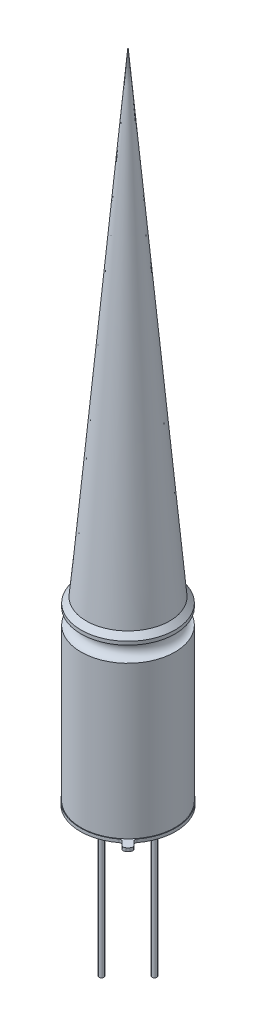
ISO-10303-21;
HEADER;
FILE_DESCRIPTION(('STEP AP214'),'2;1');
FILE_NAME('part.step','',(''),(''),'','','');
FILE_SCHEMA(('AUTOMOTIVE_DESIGN { 1 0 10303 214 1 1 1 1 }'));
ENDSEC;
DATA;
#1=APPLICATION_CONTEXT('core data for automotive mechanical design processes');
#2=APPLICATION_PROTOCOL_DEFINITION('international standard','automotive_design',2000,#1);
#3=PRODUCT_CONTEXT('',#1,'mechanical');
#4=PRODUCT('Part','Part','',(#3));
#5=PRODUCT_RELATED_PRODUCT_CATEGORY('part','',(#4));
#6=PRODUCT_DEFINITION_FORMATION('','',#4);
#7=PRODUCT_DEFINITION_CONTEXT('part definition',#1,'design');
#8=PRODUCT_DEFINITION('design','',#6,#7);
#9=PRODUCT_DEFINITION_SHAPE('','',#8);
#10=(LENGTH_UNIT() NAMED_UNIT(*) SI_UNIT(.MILLI.,.METRE.));
#11=(NAMED_UNIT(*) PLANE_ANGLE_UNIT() SI_UNIT($,.RADIAN.));
#12=(NAMED_UNIT(*) SI_UNIT($,.STERADIAN.) SOLID_ANGLE_UNIT());
#13=UNCERTAINTY_MEASURE_WITH_UNIT(LENGTH_MEASURE(1.E-05),#10,'distance_accuracy_value','');
#14=(GEOMETRIC_REPRESENTATION_CONTEXT(3) GLOBAL_UNCERTAINTY_ASSIGNED_CONTEXT((#13)) GLOBAL_UNIT_ASSIGNED_CONTEXT((#10,
#11,#12)) REPRESENTATION_CONTEXT('',''));
#15=CARTESIAN_POINT('',(0.,0.,0.));
#16=DIRECTION('',(0.,0.,1.));
#17=DIRECTION('',(1.,0.,0.));
#18=AXIS2_PLACEMENT_3D('',#15,#16,#17);
#19=CARTESIAN_POINT('',(0.,-1.58,0.));
#20=DIRECTION('',(0.,1.,0.));
#21=DIRECTION('',(0.,0.,1.));
#22=AXIS2_PLACEMENT_3D('',#19,#20,#21);
#23=TOROIDAL_SURFACE('',#22,4.5,0.749999999999999);
#24=CARTESIAN_POINT('',(0.,-2.33,0.));
#25=DIRECTION('',(0.,1.,0.));
#26=DIRECTION('',(0.,0.,1.));
#27=AXIS2_PLACEMENT_3D('',#24,#25,#26);
#28=CIRCLE('',#27,4.5);
#29=CARTESIAN_POINT('',(0.,-2.33,4.5));
#30=VERTEX_POINT('',#29);
#31=EDGE_CURVE('E203',#30,#30,#28,.T.);
#32=ORIENTED_EDGE('',*,*,#31,.T.);
#33=EDGE_LOOP('',(#32));
#34=FACE_BOUND('',#33,.T.);
#35=CARTESIAN_POINT('',(0.,-0.830000000000001,0.));
#36=DIRECTION('',(0.,1.,0.));
#37=DIRECTION('',(0.,0.,1.));
#38=AXIS2_PLACEMENT_3D('',#35,#36,#37);
#39=CIRCLE('',#38,4.5);
#40=CARTESIAN_POINT('',(0.,-0.830000000000001,4.5));
#41=VERTEX_POINT('',#40);
#42=EDGE_CURVE('E126',#41,#41,#39,.T.);
#43=ORIENTED_EDGE('',*,*,#42,.F.);
#44=EDGE_LOOP('',(#43));
#45=FACE_BOUND('',#44,.T.);
#46=ADVANCED_FACE('F47',(#34,#45),#23,.F.);
#47=CARTESIAN_POINT('',(0.,11.5793174767322,0.));
#48=DIRECTION('',(0.,1.,0.));
#49=DIRECTION('',(0.,0.,1.));
#50=AXIS2_PLACEMENT_3D('',#47,#48,#49);
#51=CYLINDRICAL_SURFACE('',#50,4.5);
#52=ORIENTED_EDGE('',*,*,#42,.T.);
#53=EDGE_LOOP('',(#52));
#54=FACE_BOUND('',#53,.T.);
#55=CARTESIAN_POINT('',(0.,-0.5,0.));
#56=DIRECTION('',(0.,1.,0.));
#57=DIRECTION('',(0.,0.,1.));
#58=AXIS2_PLACEMENT_3D('',#55,#56,#57);
#59=CIRCLE('',#58,4.5);
#60=CARTESIAN_POINT('',(0.,-0.5,4.5));
#61=VERTEX_POINT('',#60);
#62=EDGE_CURVE('E122',#61,#61,#59,.T.);
#63=ORIENTED_EDGE('',*,*,#62,.F.);
#64=EDGE_LOOP('',(#63));
#65=FACE_BOUND('',#64,.T.);
#66=ADVANCED_FACE('F254',(#54,#65),#51,.T.);
#67=CARTESIAN_POINT('',(0.,0.,0.));
#68=DIRECTION('',(0.,-1.,0.));
#69=DIRECTION('',(0.,0.,-1.));
#70=AXIS2_PLACEMENT_3D('',#67,#68,#69);
#71=CONICAL_SURFACE('',#70,4.,0.785398163397447);
#72=ORIENTED_EDGE('',*,*,#62,.T.);
#73=EDGE_LOOP('',(#72));
#74=FACE_BOUND('',#73,.T.);
#75=CARTESIAN_POINT('',(0.,0.,0.));
#76=DIRECTION('',(0.,1.,0.));
#77=DIRECTION('',(0.,0.,1.));
#78=AXIS2_PLACEMENT_3D('',#75,#76,#77);
#79=CIRCLE('',#78,4.);
#80=CARTESIAN_POINT('',(0.,0.,4.));
#81=VERTEX_POINT('',#80);
#82=EDGE_CURVE('E120',#81,#81,#79,.T.);
#83=ORIENTED_EDGE('',*,*,#82,.F.);
#84=EDGE_LOOP('',(#83));
#85=FACE_BOUND('',#84,.T.);
#86=ADVANCED_FACE('F259',(#74,#85),#71,.T.);
#87=CARTESIAN_POINT('',(0.,-17.2,0.));
#88=DIRECTION('',(0.,1.,0.));
#89=DIRECTION('',(0.,0.,1.));
#90=AXIS2_PLACEMENT_3D('',#87,#88,#89);
#91=PLANE('',#90);
#92=CARTESIAN_POINT('',(0.,-17.2,-2.54));
#93=DIRECTION('',(0.,1.,0.));
#94=DIRECTION('',(0.,0.,1.));
#95=AXIS2_PLACEMENT_3D('',#92,#93,#94);
#96=CIRCLE('',#95,0.225);
#97=CARTESIAN_POINT('',(0.,-17.2,-2.315));
#98=VERTEX_POINT('',#97);
#99=EDGE_CURVE('E144',#98,#98,#96,.F.);
#100=ORIENTED_EDGE('',*,*,#99,.F.);
#101=EDGE_LOOP('',(#100));
#102=FACE_BOUND('',#101,.T.);
#103=CARTESIAN_POINT('',(2.54,-17.2,0.));
#104=DIRECTION('',(0.,1.,0.));
#105=DIRECTION('',(0.,0.,1.));
#106=AXIS2_PLACEMENT_3D('',#103,#104,#105);
#107=CIRCLE('',#106,0.225);
#108=CARTESIAN_POINT('',(2.54,-17.2,0.224999999999982));
#109=VERTEX_POINT('',#108);
#110=EDGE_CURVE('E141',#109,#109,#107,.F.);
#111=ORIENTED_EDGE('',*,*,#110,.F.);
#112=EDGE_LOOP('',(#111));
#113=FACE_BOUND('',#112,.T.);
#114=CARTESIAN_POINT('',(0.,-17.2,2.54));
#115=DIRECTION('',(0.,1.,0.));
#116=DIRECTION('',(0.,0.,1.));
#117=AXIS2_PLACEMENT_3D('',#114,#115,#116);
#118=CIRCLE('',#117,0.225);
#119=CARTESIAN_POINT('',(0.,-17.2,2.765));
#120=VERTEX_POINT('',#119);
#121=EDGE_CURVE('E138',#120,#120,#118,.F.);
#122=ORIENTED_EDGE('',*,*,#121,.F.);
#123=EDGE_LOOP('',(#122));
#124=FACE_BOUND('',#123,.T.);
#125=CARTESIAN_POINT('',(-2.54,-17.2,0.));
#126=DIRECTION('',(0.,1.,0.));
#127=DIRECTION('',(0.,0.,1.));
#128=AXIS2_PLACEMENT_3D('',#125,#126,#127);
#129=CIRCLE('',#128,0.225);
#130=CARTESIAN_POINT('',(-2.54,-17.2,0.225));
#131=VERTEX_POINT('',#130);
#132=EDGE_CURVE('E135',#131,#131,#129,.F.);
#133=ORIENTED_EDGE('',*,*,#132,.F.);
#134=EDGE_LOOP('',(#133));
#135=FACE_BOUND('',#134,.T.);
#136=DIRECTION('',(0.707106781186551,0.,0.707106781186544));
#137=VECTOR('',#136,1.);
#138=CARTESIAN_POINT('',(3.49482029645619,-17.2,2.92913487150692));
#139=LINE('',#138,#137);
#140=CARTESIAN_POINT('',(3.65282787564673,-17.2,3.08714245069745));
#141=VERTEX_POINT('',#140);
#142=CARTESIAN_POINT('',(4.02515038234611,-17.2,3.45946495739683));
#143=VERTEX_POINT('',#142);
#144=EDGE_CURVE('E181',#141,#143,#139,.T.);
#145=ORIENTED_EDGE('',*,*,#144,.T.);
#146=CARTESIAN_POINT('',(3.84837368704947,-17.2,3.63624165269347));
#147=DIRECTION('',(0.,1.,0.));
#148=DIRECTION('',(0.,0.,1.));
#149=AXIS2_PLACEMENT_3D('',#146,#147,#148);
#150=CIRCLE('',#149,0.25);
#151=CARTESIAN_POINT('',(4.02515038234611,-17.2,3.8130183479901));
#152=VERTEX_POINT('',#151);
#153=EDGE_CURVE('E154',#143,#152,#150,.F.);
#154=ORIENTED_EDGE('',*,*,#153,.T.);
#155=DIRECTION('',(-0.707106781186545,0.,0.70710678118655));
#156=VECTOR('',#155,1.);
#157=CARTESIAN_POINT('',(3.63624165269351,-17.2,4.20192707764271));
#158=LINE('',#157,#156);
#159=CARTESIAN_POINT('',(3.81301834799015,-17.2,4.02515038234607));
#160=VERTEX_POINT('',#159);
#161=EDGE_CURVE('E190',#152,#160,#158,.T.);
#162=ORIENTED_EDGE('',*,*,#161,.T.);
#163=CARTESIAN_POINT('',(3.63624165269351,-17.2,3.84837368704943));
#164=DIRECTION('',(0.,1.,0.));
#165=DIRECTION('',(0.,0.,1.));
#166=AXIS2_PLACEMENT_3D('',#163,#164,#165);
#167=CIRCLE('',#166,0.25);
#168=CARTESIAN_POINT('',(3.45946495739687,-17.2,4.02515038234607));
#169=VERTEX_POINT('',#168);
#170=EDGE_CURVE('E152',#160,#169,#167,.F.);
#171=ORIENTED_EDGE('',*,*,#170,.T.);
#172=DIRECTION('',(-0.707106781186551,0.,-0.707106781186544));
#173=VECTOR('',#172,1.);
#174=CARTESIAN_POINT('',(2.92913487150696,-17.2,3.49482029645616));
#175=LINE('',#174,#173);
#176=CARTESIAN_POINT('',(3.08714245069749,-17.2,3.65282787564669));
#177=VERTEX_POINT('',#176);
#178=EDGE_CURVE('E225',#169,#177,#175,.T.);
#179=ORIENTED_EDGE('',*,*,#178,.T.);
#180=CARTESIAN_POINT('',(2.91036575540085,-17.2,3.82960457094333));
#181=DIRECTION('',(0.,1.,0.));
#182=DIRECTION('',(0.,0.,1.));
#183=AXIS2_PLACEMENT_3D('',#180,#181,#182);
#184=CIRCLE('',#183,0.25);
#185=CARTESIAN_POINT('',(2.75909934399748,-17.2,3.63056067432465));
#186=VERTEX_POINT('',#185);
#187=EDGE_CURVE('E174',#177,#186,#184,.T.);
#188=ORIENTED_EDGE('',*,*,#187,.T.);
#189=CARTESIAN_POINT('',(0.,-17.2,0.));
#190=DIRECTION('',(0.,1.,0.));
#191=DIRECTION('',(0.,0.,1.));
#192=AXIS2_PLACEMENT_3D('',#189,#190,#191);
#193=CIRCLE('',#192,4.56);
#194=CARTESIAN_POINT('',(3.63056067432468,-17.2,2.75909934399744));
#195=VERTEX_POINT('',#194);
#196=EDGE_CURVE('E123',#195,#186,#193,.T.);
#197=ORIENTED_EDGE('',*,*,#196,.F.);
#198=CARTESIAN_POINT('',(3.82960457094336,-17.2,2.91036575540081));
#199=DIRECTION('',(0.,1.,0.));
#200=DIRECTION('',(0.,0.,1.));
#201=AXIS2_PLACEMENT_3D('',#198,#199,#200);
#202=CIRCLE('',#201,0.25);
#203=EDGE_CURVE('E55',#195,#141,#202,.T.);
#204=ORIENTED_EDGE('',*,*,#203,.T.);
#205=EDGE_LOOP('',(#145,#154,#162,#171,#179,#188,#197,#204));
#206=FACE_BOUND('',#205,.T.);
#207=ADVANCED_FACE('F180',(#102,#113,#124,#135,#206),#91,.F.);
#208=CARTESIAN_POINT('',(0.,11.5793174767322,0.));
#209=DIRECTION('',(0.,1.,0.));
#210=DIRECTION('',(0.,0.,1.));
#211=AXIS2_PLACEMENT_3D('',#208,#209,#210);
#212=CYLINDRICAL_SURFACE('',#211,4.56);
#213=ORIENTED_EDGE('',*,*,#196,.T.);
#214=DIRECTION('',(0.,1.,0.));
#215=VECTOR('',#214,1.);
#216=CARTESIAN_POINT('',(2.75909934399748,11.5793174767322,3.63056067432465));
#217=LINE('',#216,#215);
#218=CARTESIAN_POINT('',(2.75909934399748,-16.9,3.63056067432465));
#219=VERTEX_POINT('',#218);
#220=EDGE_CURVE('E172',#186,#219,#217,.T.);
#221=ORIENTED_EDGE('',*,*,#220,.T.);
#222=CARTESIAN_POINT('',(0.,-16.9,0.));
#223=DIRECTION('',(0.,1.,0.));
#224=DIRECTION('',(0.,0.,1.));
#225=AXIS2_PLACEMENT_3D('',#222,#223,#224);
#226=CIRCLE('',#225,4.56);
#227=CARTESIAN_POINT('',(3.63056067432468,-16.9,2.75909934399744));
#228=VERTEX_POINT('',#227);
#229=EDGE_CURVE('E129',#228,#219,#226,.T.);
#230=ORIENTED_EDGE('',*,*,#229,.F.);
#231=DIRECTION('',(0.,1.,0.));
#232=VECTOR('',#231,1.);
#233=CARTESIAN_POINT('',(3.63056067432468,11.5793174767322,2.75909934399744));
#234=LINE('',#233,#232);
#235=EDGE_CURVE('E169',#228,#195,#234,.F.);
#236=ORIENTED_EDGE('',*,*,#235,.T.);
#237=EDGE_LOOP('',(#213,#221,#230,#236));
#238=FACE_BOUND('',#237,.T.);
#239=ADVANCED_FACE('F199',(#238),#212,.T.);
#240=CARTESIAN_POINT('',(0.,-16.9,0.));
#241=DIRECTION('',(0.,1.,0.));
#242=DIRECTION('',(0.,0.,1.));
#243=AXIS2_PLACEMENT_3D('',#240,#241,#242);
#244=PLANE('',#243);
#245=DIRECTION('',(-0.707106781186545,0.,0.70710678118655));
#246=VECTOR('',#245,1.);
#247=CARTESIAN_POINT('',(3.63624165269351,-16.9,4.20192707764271));
#248=LINE('',#247,#246);
#249=CARTESIAN_POINT('',(4.02515038234611,-16.9,3.8130183479901));
#250=VERTEX_POINT('',#249);
#251=CARTESIAN_POINT('',(3.81301834799015,-16.9,4.02515038234607));
#252=VERTEX_POINT('',#251);
#253=EDGE_CURVE('E221',#250,#252,#248,.T.);
#254=ORIENTED_EDGE('',*,*,#253,.F.);
#255=CARTESIAN_POINT('',(3.84837368704947,-16.9,3.63624165269347));
#256=DIRECTION('',(0.,1.,0.));
#257=DIRECTION('',(0.,0.,1.));
#258=AXIS2_PLACEMENT_3D('',#255,#256,#257);
#259=CIRCLE('',#258,0.25);
#260=CARTESIAN_POINT('',(4.02515038234611,-16.9,3.45946495739683));
#261=VERTEX_POINT('',#260);
#262=EDGE_CURVE('E163',#250,#261,#259,.T.);
#263=ORIENTED_EDGE('',*,*,#262,.T.);
#264=DIRECTION('',(0.707106781186551,0.,0.707106781186544));
#265=VECTOR('',#264,1.);
#266=CARTESIAN_POINT('',(3.49482029645619,-16.9,2.92913487150692));
#267=LINE('',#266,#265);
#268=CARTESIAN_POINT('',(3.65282787564673,-16.9,3.08714245069745));
#269=VERTEX_POINT('',#268);
#270=EDGE_CURVE('E197',#269,#261,#267,.T.);
#271=ORIENTED_EDGE('',*,*,#270,.F.);
#272=CARTESIAN_POINT('',(3.82960457094336,-16.9,2.91036575540081));
#273=DIRECTION('',(0.,1.,0.));
#274=DIRECTION('',(0.,0.,1.));
#275=AXIS2_PLACEMENT_3D('',#272,#273,#274);
#276=CIRCLE('',#275,0.25);
#277=EDGE_CURVE('E13',#269,#228,#276,.F.);
#278=ORIENTED_EDGE('',*,*,#277,.T.);
#279=ORIENTED_EDGE('',*,*,#229,.T.);
#280=CARTESIAN_POINT('',(2.91036575540085,-16.9,3.82960457094333));
#281=DIRECTION('',(0.,1.,0.));
#282=DIRECTION('',(0.,0.,1.));
#283=AXIS2_PLACEMENT_3D('',#280,#281,#282);
#284=CIRCLE('',#283,0.25);
#285=CARTESIAN_POINT('',(3.08714245069749,-16.9,3.65282787564669));
#286=VERTEX_POINT('',#285);
#287=EDGE_CURVE('E62',#219,#286,#284,.F.);
#288=ORIENTED_EDGE('',*,*,#287,.T.);
#289=DIRECTION('',(-0.707106781186551,0.,-0.707106781186544));
#290=VECTOR('',#289,1.);
#291=CARTESIAN_POINT('',(2.92913487150696,-16.9,3.49482029645616));
#292=LINE('',#291,#290);
#293=CARTESIAN_POINT('',(3.45946495739687,-16.9,4.02515038234607));
#294=VERTEX_POINT('',#293);
#295=EDGE_CURVE('E220',#294,#286,#292,.T.);
#296=ORIENTED_EDGE('',*,*,#295,.F.);
#297=CARTESIAN_POINT('',(3.63624165269351,-16.9,3.84837368704943));
#298=DIRECTION('',(0.,1.,0.));
#299=DIRECTION('',(0.,0.,1.));
#300=AXIS2_PLACEMENT_3D('',#297,#298,#299);
#301=CIRCLE('',#300,0.25);
#302=EDGE_CURVE('E161',#294,#252,#301,.T.);
#303=ORIENTED_EDGE('',*,*,#302,.T.);
#304=EDGE_LOOP('',(#254,#263,#271,#278,#279,#288,#296,#303));
#305=FACE_BOUND('',#304,.T.);
#306=CARTESIAN_POINT('',(0.,-16.9,0.));
#307=DIRECTION('',(0.,1.,0.));
#308=DIRECTION('',(0.,0.,1.));
#309=AXIS2_PLACEMENT_3D('',#306,#307,#308);
#310=CIRCLE('',#309,4.5);
#311=CARTESIAN_POINT('',(0.,-16.9,4.5));
#312=VERTEX_POINT('',#311);
#313=EDGE_CURVE('E201',#312,#312,#310,.T.);
#314=ORIENTED_EDGE('',*,*,#313,.F.);
#315=EDGE_LOOP('',(#314));
#316=FACE_BOUND('',#315,.T.);
#317=ADVANCED_FACE('F195',(#305,#316),#244,.T.);
#318=CARTESIAN_POINT('',(0.,11.5793174767322,0.));
#319=DIRECTION('',(0.,1.,0.));
#320=DIRECTION('',(0.,0.,1.));
#321=AXIS2_PLACEMENT_3D('',#318,#319,#320);
#322=CYLINDRICAL_SURFACE('',#321,4.5);
#323=ORIENTED_EDGE('',*,*,#313,.T.);
#324=EDGE_LOOP('',(#323));
#325=FACE_BOUND('',#324,.T.);
#326=ORIENTED_EDGE('',*,*,#31,.F.);
#327=EDGE_LOOP('',(#326));
#328=FACE_BOUND('',#327,.T.);
#329=ADVANCED_FACE('F274',(#325,#328),#322,.T.);
#330=CARTESIAN_POINT('',(-2.54,-30.2,0.));
#331=DIRECTION('',(0.,1.,0.));
#332=DIRECTION('',(0.,0.,1.));
#333=AXIS2_PLACEMENT_3D('',#330,#331,#332);
#334=CYLINDRICAL_SURFACE('',#333,0.225);
#335=CARTESIAN_POINT('',(-2.54,-30.2,0.));
#336=DIRECTION('',(0.,-1.,0.));
#337=DIRECTION('',(0.,0.,-1.));
#338=AXIS2_PLACEMENT_3D('',#335,#336,#337);
#339=CIRCLE('',#338,0.225);
#340=CARTESIAN_POINT('',(-2.54,-30.2,-0.225));
#341=VERTEX_POINT('',#340);
#342=EDGE_CURVE('E208',#341,#341,#339,.T.);
#343=ORIENTED_EDGE('',*,*,#342,.F.);
#344=EDGE_LOOP('',(#343));
#345=FACE_BOUND('',#344,.T.);
#346=ORIENTED_EDGE('',*,*,#132,.T.);
#347=EDGE_LOOP('',(#346));
#348=FACE_BOUND('',#347,.T.);
#349=ADVANCED_FACE('F277',(#345,#348),#334,.T.);
#350=CARTESIAN_POINT('',(-2.54,-30.2,0.));
#351=DIRECTION('',(0.,-1.,0.));
#352=DIRECTION('',(0.,0.,-1.));
#353=AXIS2_PLACEMENT_3D('',#350,#351,#352);
#354=PLANE('',#353);
#355=ORIENTED_EDGE('',*,*,#342,.T.);
#356=EDGE_LOOP('',(#355));
#357=FACE_BOUND('',#356,.T.);
#358=ADVANCED_FACE('F281',(#357),#354,.T.);
#359=CARTESIAN_POINT('',(0.,-30.2,2.54));
#360=DIRECTION('',(0.,1.,0.));
#361=DIRECTION('',(0.,0.,1.));
#362=AXIS2_PLACEMENT_3D('',#359,#360,#361);
#363=CYLINDRICAL_SURFACE('',#362,0.225);
#364=CARTESIAN_POINT('',(0.,-30.2,2.54));
#365=DIRECTION('',(0.,-1.,0.));
#366=DIRECTION('',(0.,0.,-1.));
#367=AXIS2_PLACEMENT_3D('',#364,#365,#366);
#368=CIRCLE('',#367,0.225);
#369=CARTESIAN_POINT('',(0.,-30.2,2.315));
#370=VERTEX_POINT('',#369);
#371=EDGE_CURVE('E211',#370,#370,#368,.T.);
#372=ORIENTED_EDGE('',*,*,#371,.F.);
#373=EDGE_LOOP('',(#372));
#374=FACE_BOUND('',#373,.T.);
#375=ORIENTED_EDGE('',*,*,#121,.T.);
#376=EDGE_LOOP('',(#375));
#377=FACE_BOUND('',#376,.T.);
#378=ADVANCED_FACE('F285',(#374,#377),#363,.T.);
#379=CARTESIAN_POINT('',(0.,-30.2,2.54));
#380=DIRECTION('',(0.,-1.,0.));
#381=DIRECTION('',(0.,0.,-1.));
#382=AXIS2_PLACEMENT_3D('',#379,#380,#381);
#383=PLANE('',#382);
#384=ORIENTED_EDGE('',*,*,#371,.T.);
#385=EDGE_LOOP('',(#384));
#386=FACE_BOUND('',#385,.T.);
#387=ADVANCED_FACE('F289',(#386),#383,.T.);
#388=CARTESIAN_POINT('',(2.54,-30.2,0.));
#389=DIRECTION('',(0.,1.,0.));
#390=DIRECTION('',(0.,0.,1.));
#391=AXIS2_PLACEMENT_3D('',#388,#389,#390);
#392=CYLINDRICAL_SURFACE('',#391,0.225);
#393=CARTESIAN_POINT('',(2.54,-30.2,0.));
#394=DIRECTION('',(0.,-1.,0.));
#395=DIRECTION('',(0.,0.,-1.));
#396=AXIS2_PLACEMENT_3D('',#393,#394,#395);
#397=CIRCLE('',#396,0.225);
#398=CARTESIAN_POINT('',(2.54,-30.2,-0.225000000000018));
#399=VERTEX_POINT('',#398);
#400=EDGE_CURVE('E214',#399,#399,#397,.T.);
#401=ORIENTED_EDGE('',*,*,#400,.F.);
#402=EDGE_LOOP('',(#401));
#403=FACE_BOUND('',#402,.T.);
#404=ORIENTED_EDGE('',*,*,#110,.T.);
#405=EDGE_LOOP('',(#404));
#406=FACE_BOUND('',#405,.T.);
#407=ADVANCED_FACE('F293',(#403,#406),#392,.T.);
#408=CARTESIAN_POINT('',(2.54,-30.2,0.));
#409=DIRECTION('',(0.,-1.,0.));
#410=DIRECTION('',(0.,0.,-1.));
#411=AXIS2_PLACEMENT_3D('',#408,#409,#410);
#412=PLANE('',#411);
#413=ORIENTED_EDGE('',*,*,#400,.T.);
#414=EDGE_LOOP('',(#413));
#415=FACE_BOUND('',#414,.T.);
#416=ADVANCED_FACE('F297',(#415),#412,.T.);
#417=CARTESIAN_POINT('',(0.,-30.2,-2.54));
#418=DIRECTION('',(0.,1.,0.));
#419=DIRECTION('',(0.,0.,1.));
#420=AXIS2_PLACEMENT_3D('',#417,#418,#419);
#421=CYLINDRICAL_SURFACE('',#420,0.225);
#422=CARTESIAN_POINT('',(0.,-30.2,-2.54));
#423=DIRECTION('',(0.,-1.,0.));
#424=DIRECTION('',(0.,0.,-1.));
#425=AXIS2_PLACEMENT_3D('',#422,#423,#424);
#426=CIRCLE('',#425,0.225);
#427=CARTESIAN_POINT('',(0.,-30.2,-2.765));
#428=VERTEX_POINT('',#427);
#429=EDGE_CURVE('E217',#428,#428,#426,.T.);
#430=ORIENTED_EDGE('',*,*,#429,.F.);
#431=EDGE_LOOP('',(#430));
#432=FACE_BOUND('',#431,.T.);
#433=ORIENTED_EDGE('',*,*,#99,.T.);
#434=EDGE_LOOP('',(#433));
#435=FACE_BOUND('',#434,.T.);
#436=ADVANCED_FACE('F301',(#432,#435),#421,.T.);
#437=CARTESIAN_POINT('',(0.,-30.2,-2.54));
#438=DIRECTION('',(0.,-1.,0.));
#439=DIRECTION('',(0.,0.,-1.));
#440=AXIS2_PLACEMENT_3D('',#437,#438,#439);
#441=PLANE('',#440);
#442=ORIENTED_EDGE('',*,*,#429,.T.);
#443=EDGE_LOOP('',(#442));
#444=FACE_BOUND('',#443,.T.);
#445=ADVANCED_FACE('F305',(#444),#441,.T.);
#446=CARTESIAN_POINT('',(3.49482029645619,-15.1,2.92913487150692));
#447=DIRECTION('',(0.707106781186544,0.,-0.707106781186551));
#448=DIRECTION('',(-0.707106781186551,0.,-0.707106781186544));
#449=AXIS2_PLACEMENT_3D('',#446,#447,#448);
#450=PLANE('',#449);
#451=ORIENTED_EDGE('',*,*,#270,.T.);
#452=DIRECTION('',(0.,-1.,0.));
#453=VECTOR('',#452,1.);
#454=CARTESIAN_POINT('',(4.02515038234611,-15.1,3.45946495739683));
#455=LINE('',#454,#453);
#456=EDGE_CURVE('E149',#261,#143,#455,.T.);
#457=ORIENTED_EDGE('',*,*,#456,.T.);
#458=ORIENTED_EDGE('',*,*,#144,.F.);
#459=DIRECTION('',(0.,1.,0.));
#460=VECTOR('',#459,1.);
#461=CARTESIAN_POINT('',(3.65282787564673,-15.1,3.08714245069745));
#462=LINE('',#461,#460);
#463=EDGE_CURVE('E147',#141,#269,#462,.T.);
#464=ORIENTED_EDGE('',*,*,#463,.T.);
#465=EDGE_LOOP('',(#451,#457,#458,#464));
#466=FACE_BOUND('',#465,.T.);
#467=ADVANCED_FACE('F187',(#466),#450,.T.);
#468=CARTESIAN_POINT('',(3.63624165269351,-15.1,4.20192707764271));
#469=DIRECTION('',(0.70710678118655,0.,0.707106781186545));
#470=DIRECTION('',(0.707106781186545,0.,-0.70710678118655));
#471=AXIS2_PLACEMENT_3D('',#468,#469,#470);
#472=PLANE('',#471);
#473=ORIENTED_EDGE('',*,*,#161,.F.);
#474=DIRECTION('',(0.,-1.,0.));
#475=VECTOR('',#474,1.);
#476=CARTESIAN_POINT('',(4.02515038234611,-15.1,3.8130183479901));
#477=LINE('',#476,#475);
#478=EDGE_CURVE('E159',#152,#250,#477,.F.);
#479=ORIENTED_EDGE('',*,*,#478,.T.);
#480=ORIENTED_EDGE('',*,*,#253,.T.);
#481=DIRECTION('',(0.,-1.,0.));
#482=VECTOR('',#481,1.);
#483=CARTESIAN_POINT('',(3.81301834799015,-15.1,4.02515038234607));
#484=LINE('',#483,#482);
#485=EDGE_CURVE('E156',#252,#160,#484,.T.);
#486=ORIENTED_EDGE('',*,*,#485,.T.);
#487=EDGE_LOOP('',(#473,#479,#480,#486));
#488=FACE_BOUND('',#487,.T.);
#489=ADVANCED_FACE('F239',(#488),#472,.T.);
#490=CARTESIAN_POINT('',(2.92913487150696,-15.1,3.49482029645616));
#491=DIRECTION('',(-0.707106781186544,0.,0.707106781186551));
#492=DIRECTION('',(0.707106781186551,0.,0.707106781186544));
#493=AXIS2_PLACEMENT_3D('',#490,#491,#492);
#494=PLANE('',#493);
#495=ORIENTED_EDGE('',*,*,#178,.F.);
#496=DIRECTION('',(0.,-1.,0.));
#497=VECTOR('',#496,1.);
#498=CARTESIAN_POINT('',(3.45946495739687,-15.1,4.02515038234607));
#499=LINE('',#498,#497);
#500=EDGE_CURVE('E69',#169,#294,#499,.F.);
#501=ORIENTED_EDGE('',*,*,#500,.T.);
#502=ORIENTED_EDGE('',*,*,#295,.T.);
#503=DIRECTION('',(0.,1.,0.));
#504=VECTOR('',#503,1.);
#505=CARTESIAN_POINT('',(3.08714245069749,-15.1,3.65282787564669));
#506=LINE('',#505,#504);
#507=EDGE_CURVE('E165',#286,#177,#506,.F.);
#508=ORIENTED_EDGE('',*,*,#507,.T.);
#509=EDGE_LOOP('',(#495,#501,#502,#508));
#510=FACE_BOUND('',#509,.T.);
#511=ADVANCED_FACE('F230',(#510),#494,.T.);
#512=CARTESIAN_POINT('',(3.84837368704947,-15.1,3.63624165269347));
#513=DIRECTION('',(0.,-1.,0.));
#514=DIRECTION('',(0.,0.,-1.));
#515=AXIS2_PLACEMENT_3D('',#512,#513,#514);
#516=CYLINDRICAL_SURFACE('',#515,0.25);
#517=ORIENTED_EDGE('',*,*,#262,.F.);
#518=ORIENTED_EDGE('',*,*,#478,.F.);
#519=ORIENTED_EDGE('',*,*,#153,.F.);
#520=ORIENTED_EDGE('',*,*,#456,.F.);
#521=EDGE_LOOP('',(#517,#518,#519,#520));
#522=FACE_BOUND('',#521,.T.);
#523=ADVANCED_FACE('F242',(#522),#516,.T.);
#524=CARTESIAN_POINT('',(3.63624165269351,-15.1,3.84837368704943));
#525=DIRECTION('',(0.,-1.,0.));
#526=DIRECTION('',(0.,0.,-1.));
#527=AXIS2_PLACEMENT_3D('',#524,#525,#526);
#528=CYLINDRICAL_SURFACE('',#527,0.25);
#529=ORIENTED_EDGE('',*,*,#302,.F.);
#530=ORIENTED_EDGE('',*,*,#500,.F.);
#531=ORIENTED_EDGE('',*,*,#170,.F.);
#532=ORIENTED_EDGE('',*,*,#485,.F.);
#533=EDGE_LOOP('',(#529,#530,#531,#532));
#534=FACE_BOUND('',#533,.T.);
#535=ADVANCED_FACE('F234',(#534),#528,.T.);
#536=CARTESIAN_POINT('',(2.91036575540085,11.5793174767322,3.82960457094333));
#537=DIRECTION('',(0.,1.,0.));
#538=DIRECTION('',(0.,0.,1.));
#539=AXIS2_PLACEMENT_3D('',#536,#537,#538);
#540=CYLINDRICAL_SURFACE('',#539,0.25);
#541=ORIENTED_EDGE('',*,*,#287,.F.);
#542=ORIENTED_EDGE('',*,*,#220,.F.);
#543=ORIENTED_EDGE('',*,*,#187,.F.);
#544=ORIENTED_EDGE('',*,*,#507,.F.);
#545=EDGE_LOOP('',(#541,#542,#543,#544));
#546=FACE_BOUND('',#545,.T.);
#547=ADVANCED_FACE('F249',(#546),#540,.F.);
#548=CARTESIAN_POINT('',(3.82960457094336,11.5793174767322,2.91036575540081));
#549=DIRECTION('',(0.,1.,0.));
#550=DIRECTION('',(0.,0.,1.));
#551=AXIS2_PLACEMENT_3D('',#548,#549,#550);
#552=CYLINDRICAL_SURFACE('',#551,0.25);
#553=ORIENTED_EDGE('',*,*,#277,.F.);
#554=ORIENTED_EDGE('',*,*,#463,.F.);
#555=ORIENTED_EDGE('',*,*,#203,.F.);
#556=ORIENTED_EDGE('',*,*,#235,.F.);
#557=EDGE_LOOP('',(#553,#554,#555,#556));
#558=FACE_BOUND('',#557,.T.);
#559=ADVANCED_FACE('F49',(#558),#552,.F.);
#560=CARTESIAN_POINT('',(0.,0.,0.));
#561=DIRECTION('',(0.,-1.,0.));
#562=DIRECTION('',(0.,0.,-1.));
#563=AXIS2_PLACEMENT_3D('',#560,#561,#562);
#564=CONICAL_SURFACE('',#563,4.,0.0872664625997098);
#565=CARTESIAN_POINT('',(0.,45.7202092110489,0.));
#566=VERTEX_POINT('',#565);
#567=VERTEX_LOOP('',#566);
#568=FACE_BOUND('',#567,.T.);
#569=ORIENTED_EDGE('',*,*,#82,.T.);
#570=EDGE_LOOP('',(#569));
#571=FACE_BOUND('',#570,.T.);
#572=ADVANCED_FACE('F114',(#568,#571),#564,.T.);
#573=CLOSED_SHELL('',(#46,#66,#86,#207,#239,#317,#329,#349,#358,#378,#387,#407,#416,#436,#445,
#467,#489,#511,#523,#535,#547,#559,#572));
#574=MANIFOLD_SOLID_BREP('B2',#573);
#575=ADVANCED_BREP_SHAPE_REPRESENTATION('',(#18,#574),#14);
#576=SHAPE_DEFINITION_REPRESENTATION(#9,#575);
ENDSEC;
END-ISO-10303-21;
